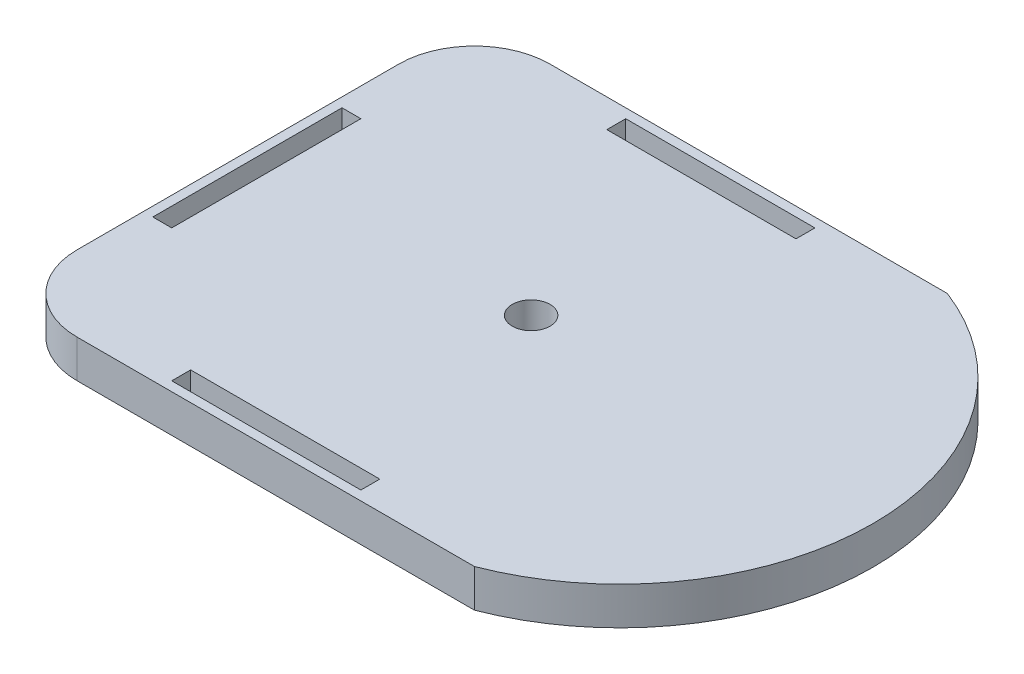
ISO-10303-21;
HEADER;
FILE_DESCRIPTION(('STEP AP214'),'2;1');
FILE_NAME('part.step','',(''),(''),'','','');
FILE_SCHEMA(('AUTOMOTIVE_DESIGN { 1 0 10303 214 1 1 1 1 }'));
ENDSEC;
DATA;
#1=APPLICATION_CONTEXT('core data for automotive mechanical design processes');
#2=APPLICATION_PROTOCOL_DEFINITION('international standard','automotive_design',2000,#1);
#3=PRODUCT_CONTEXT('',#1,'mechanical');
#4=PRODUCT('Part','Part','',(#3));
#5=PRODUCT_RELATED_PRODUCT_CATEGORY('part','',(#4));
#6=PRODUCT_DEFINITION_FORMATION('','',#4);
#7=PRODUCT_DEFINITION_CONTEXT('part definition',#1,'design');
#8=PRODUCT_DEFINITION('design','',#6,#7);
#9=PRODUCT_DEFINITION_SHAPE('','',#8);
#10=(LENGTH_UNIT() NAMED_UNIT(*) SI_UNIT(.MILLI.,.METRE.));
#11=(NAMED_UNIT(*) PLANE_ANGLE_UNIT() SI_UNIT($,.RADIAN.));
#12=(NAMED_UNIT(*) SI_UNIT($,.STERADIAN.) SOLID_ANGLE_UNIT());
#13=UNCERTAINTY_MEASURE_WITH_UNIT(LENGTH_MEASURE(1.E-05),#10,'distance_accuracy_value','');
#14=(GEOMETRIC_REPRESENTATION_CONTEXT(3) GLOBAL_UNCERTAINTY_ASSIGNED_CONTEXT((#13)) GLOBAL_UNIT_ASSIGNED_CONTEXT((#10,
#11,#12)) REPRESENTATION_CONTEXT('',''));
#15=CARTESIAN_POINT('',(0.,0.,0.));
#16=DIRECTION('',(0.,0.,1.));
#17=DIRECTION('',(1.,0.,0.));
#18=AXIS2_PLACEMENT_3D('',#15,#16,#17);
#19=CARTESIAN_POINT('',(120.608338299273,20.,-68.880424863026));
#20=DIRECTION('',(0.,-1.,0.));
#21=DIRECTION('',(0.,0.,-1.));
#22=AXIS2_PLACEMENT_3D('',#19,#20,#21);
#23=CYLINDRICAL_SURFACE('',#22,133.994925586997);
#24=CARTESIAN_POINT('',(120.608338299273,0.,-68.880424863026));
#25=DIRECTION('',(0.,1.,0.));
#26=DIRECTION('',(0.,0.,-1.));
#27=AXIS2_PLACEMENT_3D('',#24,#25,#26);
#28=CIRCLE('',#27,133.994925586997);
#29=CARTESIAN_POINT('',(168.874683541739,0.,56.119575136974));
#30=VERTEX_POINT('',#29);
#31=CARTESIAN_POINT('',(168.874683541739,0.,-193.880424863026));
#32=VERTEX_POINT('',#31);
#33=EDGE_CURVE('E202',#30,#32,#28,.T.);
#34=ORIENTED_EDGE('',*,*,#33,.T.);
#35=DIRECTION('',(0.,-1.,0.));
#36=VECTOR('',#35,1.);
#37=CARTESIAN_POINT('',(168.874683541739,20.,-193.880424863026));
#38=LINE('',#37,#36);
#39=CARTESIAN_POINT('',(168.874683541739,20.,-193.880424863026));
#40=VERTEX_POINT('',#39);
#41=EDGE_CURVE('E11',#40,#32,#38,.T.);
#42=ORIENTED_EDGE('',*,*,#41,.F.);
#43=CARTESIAN_POINT('',(120.608338299273,20.,-68.880424863026));
#44=DIRECTION('',(0.,1.,0.));
#45=DIRECTION('',(0.,0.,-1.));
#46=AXIS2_PLACEMENT_3D('',#43,#44,#45);
#47=CIRCLE('',#46,133.994925586997);
#48=CARTESIAN_POINT('',(168.874683541739,20.,56.119575136974));
#49=VERTEX_POINT('',#48);
#50=EDGE_CURVE('E268',#49,#40,#47,.T.);
#51=ORIENTED_EDGE('',*,*,#50,.F.);
#52=DIRECTION('',(0.,-1.,0.));
#53=VECTOR('',#52,1.);
#54=CARTESIAN_POINT('',(168.874683541739,20.,56.119575136974));
#55=LINE('',#54,#53);
#56=EDGE_CURVE('E282',#49,#30,#55,.T.);
#57=ORIENTED_EDGE('',*,*,#56,.T.);
#58=EDGE_LOOP('',(#34,#42,#51,#57));
#59=FACE_BOUND('',#58,.T.);
#60=ADVANCED_FACE('F40',(#59),#23,.T.);
#61=CARTESIAN_POINT('',(-41.1253164582612,20.,-193.880424863026));
#62=DIRECTION('',(0.,0.,1.));
#63=DIRECTION('',(1.,0.,0.));
#64=AXIS2_PLACEMENT_3D('',#61,#62,#63);
#65=PLANE('',#64);
#66=DIRECTION('',(-1.,0.,0.));
#67=VECTOR('',#66,1.);
#68=CARTESIAN_POINT('',(-41.1253164582612,0.,-193.880424863026));
#69=LINE('',#68,#67);
#70=CARTESIAN_POINT('',(-41.1253164582612,0.,-193.880424863026));
#71=VERTEX_POINT('',#70);
#72=EDGE_CURVE('E285',#32,#71,#69,.T.);
#73=ORIENTED_EDGE('',*,*,#72,.T.);
#74=DIRECTION('',(0.,-1.,0.));
#75=VECTOR('',#74,1.);
#76=CARTESIAN_POINT('',(-41.1253164582612,20.,-193.880424863026));
#77=LINE('',#76,#75);
#78=CARTESIAN_POINT('',(-41.1253164582612,20.,-193.880424863026));
#79=VERTEX_POINT('',#78);
#80=EDGE_CURVE('E48',#79,#71,#77,.T.);
#81=ORIENTED_EDGE('',*,*,#80,.F.);
#82=DIRECTION('',(-1.,0.,0.));
#83=VECTOR('',#82,1.);
#84=CARTESIAN_POINT('',(-41.1253164582612,20.,-193.880424863026));
#85=LINE('',#84,#83);
#86=EDGE_CURVE('E271',#40,#79,#85,.T.);
#87=ORIENTED_EDGE('',*,*,#86,.F.);
#88=ORIENTED_EDGE('',*,*,#41,.T.);
#89=EDGE_LOOP('',(#73,#81,#87,#88));
#90=FACE_BOUND('',#89,.T.);
#91=ADVANCED_FACE('F333',(#90),#65,.F.);
#92=CARTESIAN_POINT('',(-41.1253164582612,20.,-153.880424863026));
#93=DIRECTION('',(0.,-1.,0.));
#94=DIRECTION('',(0.,0.,-1.));
#95=AXIS2_PLACEMENT_3D('',#92,#93,#94);
#96=CYLINDRICAL_SURFACE('',#95,40.);
#97=CARTESIAN_POINT('',(-41.1253164582612,0.,-153.880424863026));
#98=DIRECTION('',(0.,1.,0.));
#99=DIRECTION('',(0.,0.,1.));
#100=AXIS2_PLACEMENT_3D('',#97,#98,#99);
#101=CIRCLE('',#100,40.);
#102=CARTESIAN_POINT('',(-81.1253164582612,0.,-153.880424863026));
#103=VERTEX_POINT('',#102);
#104=EDGE_CURVE('E287',#71,#103,#101,.T.);
#105=ORIENTED_EDGE('',*,*,#104,.T.);
#106=DIRECTION('',(0.,-1.,0.));
#107=VECTOR('',#106,1.);
#108=CARTESIAN_POINT('',(-81.1253164582612,20.,-153.880424863026));
#109=LINE('',#108,#107);
#110=CARTESIAN_POINT('',(-81.1253164582612,20.,-153.880424863026));
#111=VERTEX_POINT('',#110);
#112=EDGE_CURVE('E302',#111,#103,#109,.T.);
#113=ORIENTED_EDGE('',*,*,#112,.F.);
#114=CARTESIAN_POINT('',(-41.1253164582612,20.,-153.880424863026));
#115=DIRECTION('',(0.,1.,0.));
#116=DIRECTION('',(0.,0.,1.));
#117=AXIS2_PLACEMENT_3D('',#114,#115,#116);
#118=CIRCLE('',#117,40.);
#119=EDGE_CURVE('E274',#79,#111,#118,.T.);
#120=ORIENTED_EDGE('',*,*,#119,.F.);
#121=ORIENTED_EDGE('',*,*,#80,.T.);
#122=EDGE_LOOP('',(#105,#113,#120,#121));
#123=FACE_BOUND('',#122,.T.);
#124=ADVANCED_FACE('F310',(#123),#96,.T.);
#125=CARTESIAN_POINT('',(-81.1253164582612,20.,-153.880424863026));
#126=DIRECTION('',(1.,0.,0.));
#127=DIRECTION('',(0.,0.,-1.));
#128=AXIS2_PLACEMENT_3D('',#125,#126,#127);
#129=PLANE('',#128);
#130=DIRECTION('',(0.,0.,1.));
#131=VECTOR('',#130,1.);
#132=CARTESIAN_POINT('',(-81.1253164582612,0.,-153.880424863026));
#133=LINE('',#132,#131);
#134=CARTESIAN_POINT('',(-81.1253164582612,0.,16.119575136974));
#135=VERTEX_POINT('',#134);
#136=EDGE_CURVE('E289',#103,#135,#133,.T.);
#137=ORIENTED_EDGE('',*,*,#136,.T.);
#138=DIRECTION('',(0.,-1.,0.));
#139=VECTOR('',#138,1.);
#140=CARTESIAN_POINT('',(-81.1253164582612,20.,16.119575136974));
#141=LINE('',#140,#139);
#142=CARTESIAN_POINT('',(-81.1253164582612,20.,16.119575136974));
#143=VERTEX_POINT('',#142);
#144=EDGE_CURVE('E299',#143,#135,#141,.T.);
#145=ORIENTED_EDGE('',*,*,#144,.F.);
#146=DIRECTION('',(0.,0.,1.));
#147=VECTOR('',#146,1.);
#148=CARTESIAN_POINT('',(-81.1253164582612,20.,-153.880424863026));
#149=LINE('',#148,#147);
#150=EDGE_CURVE('E276',#111,#143,#149,.T.);
#151=ORIENTED_EDGE('',*,*,#150,.F.);
#152=ORIENTED_EDGE('',*,*,#112,.T.);
#153=EDGE_LOOP('',(#137,#145,#151,#152));
#154=FACE_BOUND('',#153,.T.);
#155=ADVANCED_FACE('F321',(#154),#129,.F.);
#156=CARTESIAN_POINT('',(-41.1253164582612,20.,16.119575136974));
#157=DIRECTION('',(0.,-1.,0.));
#158=DIRECTION('',(0.,0.,-1.));
#159=AXIS2_PLACEMENT_3D('',#156,#157,#158);
#160=CYLINDRICAL_SURFACE('',#159,40.);
#161=CARTESIAN_POINT('',(-41.1253164582612,0.,16.119575136974));
#162=DIRECTION('',(0.,1.,0.));
#163=DIRECTION('',(0.,0.,1.));
#164=AXIS2_PLACEMENT_3D('',#161,#162,#163);
#165=CIRCLE('',#164,40.);
#166=CARTESIAN_POINT('',(-41.1253164582612,0.,56.119575136974));
#167=VERTEX_POINT('',#166);
#168=EDGE_CURVE('E291',#135,#167,#165,.T.);
#169=ORIENTED_EDGE('',*,*,#168,.T.);
#170=DIRECTION('',(0.,-1.,0.));
#171=VECTOR('',#170,1.);
#172=CARTESIAN_POINT('',(-41.1253164582612,20.,56.119575136974));
#173=LINE('',#172,#171);
#174=CARTESIAN_POINT('',(-41.1253164582612,20.,56.119575136974));
#175=VERTEX_POINT('',#174);
#176=EDGE_CURVE('E296',#175,#167,#173,.T.);
#177=ORIENTED_EDGE('',*,*,#176,.F.);
#178=CARTESIAN_POINT('',(-41.1253164582612,20.,16.119575136974));
#179=DIRECTION('',(0.,1.,0.));
#180=DIRECTION('',(0.,0.,1.));
#181=AXIS2_PLACEMENT_3D('',#178,#179,#180);
#182=CIRCLE('',#181,40.);
#183=EDGE_CURVE('E278',#143,#175,#182,.T.);
#184=ORIENTED_EDGE('',*,*,#183,.F.);
#185=ORIENTED_EDGE('',*,*,#144,.T.);
#186=EDGE_LOOP('',(#169,#177,#184,#185));
#187=FACE_BOUND('',#186,.T.);
#188=ADVANCED_FACE('F325',(#187),#160,.T.);
#189=CARTESIAN_POINT('',(-41.1253164582612,20.,56.119575136974));
#190=DIRECTION('',(0.,0.,-1.));
#191=DIRECTION('',(-1.,0.,0.));
#192=AXIS2_PLACEMENT_3D('',#189,#190,#191);
#193=PLANE('',#192);
#194=DIRECTION('',(1.,0.,0.));
#195=VECTOR('',#194,1.);
#196=CARTESIAN_POINT('',(-41.1253164582612,0.,56.119575136974));
#197=LINE('',#196,#195);
#198=EDGE_CURVE('E272',#167,#30,#197,.T.);
#199=ORIENTED_EDGE('',*,*,#198,.T.);
#200=ORIENTED_EDGE('',*,*,#56,.F.);
#201=DIRECTION('',(1.,0.,0.));
#202=VECTOR('',#201,1.);
#203=CARTESIAN_POINT('',(-41.1253164582612,20.,56.119575136974));
#204=LINE('',#203,#202);
#205=EDGE_CURVE('E280',#175,#49,#204,.T.);
#206=ORIENTED_EDGE('',*,*,#205,.F.);
#207=ORIENTED_EDGE('',*,*,#176,.T.);
#208=EDGE_LOOP('',(#199,#200,#206,#207));
#209=FACE_BOUND('',#208,.T.);
#210=ADVANCED_FACE('F336',(#209),#193,.F.);
#211=CARTESIAN_POINT('',(120.608338299273,20.,-68.880424863026));
#212=DIRECTION('',(0.,-1.,0.));
#213=DIRECTION('',(0.,0.,-1.));
#214=AXIS2_PLACEMENT_3D('',#211,#212,#213);
#215=PLANE('',#214);
#216=CARTESIAN_POINT('',(68.8746835417388,20.,-73.880424863026));
#217=DIRECTION('',(0.,1.,0.));
#218=DIRECTION('',(0.,0.,1.));
#219=AXIS2_PLACEMENT_3D('',#216,#217,#218);
#220=CIRCLE('',#219,9.99999999999999);
#221=CARTESIAN_POINT('',(68.8746835417388,20.,-63.880424863026));
#222=VERTEX_POINT('',#221);
#223=EDGE_CURVE('E191',#222,#222,#220,.T.);
#224=ORIENTED_EDGE('',*,*,#223,.F.);
#225=EDGE_LOOP('',(#224));
#226=FACE_BOUND('',#225,.T.);
#227=DIRECTION('',(1.,0.,0.));
#228=VECTOR('',#227,1.);
#229=CARTESIAN_POINT('',(3.8746835417388,20.,-178.880424863026));
#230=LINE('',#229,#228);
#231=CARTESIAN_POINT('',(3.8746835417388,20.,-178.880424863026));
#232=VERTEX_POINT('',#231);
#233=CARTESIAN_POINT('',(103.874683541739,20.,-178.880424863026));
#234=VERTEX_POINT('',#233);
#235=EDGE_CURVE('E196',#232,#234,#230,.T.);
#236=ORIENTED_EDGE('',*,*,#235,.F.);
#237=DIRECTION('',(0.,0.,1.));
#238=VECTOR('',#237,1.);
#239=CARTESIAN_POINT('',(3.8746835417388,20.,-188.880424863026));
#240=LINE('',#239,#238);
#241=CARTESIAN_POINT('',(3.8746835417388,20.,-188.880424863026));
#242=VERTEX_POINT('',#241);
#243=EDGE_CURVE('E55',#242,#232,#240,.T.);
#244=ORIENTED_EDGE('',*,*,#243,.F.);
#245=DIRECTION('',(-1.,0.,0.));
#246=VECTOR('',#245,1.);
#247=CARTESIAN_POINT('',(3.8746835417388,20.,-188.880424863026));
#248=LINE('',#247,#246);
#249=CARTESIAN_POINT('',(103.874683541739,20.,-188.880424863026));
#250=VERTEX_POINT('',#249);
#251=EDGE_CURVE('E185',#250,#242,#248,.T.);
#252=ORIENTED_EDGE('',*,*,#251,.F.);
#253=DIRECTION('',(0.,0.,-1.));
#254=VECTOR('',#253,1.);
#255=CARTESIAN_POINT('',(103.874683541739,20.,-188.880424863026));
#256=LINE('',#255,#254);
#257=EDGE_CURVE('E188',#234,#250,#256,.T.);
#258=ORIENTED_EDGE('',*,*,#257,.F.);
#259=EDGE_LOOP('',(#236,#244,#252,#258));
#260=FACE_BOUND('',#259,.T.);
#261=DIRECTION('',(1.,0.,0.));
#262=VECTOR('',#261,1.);
#263=CARTESIAN_POINT('',(-76.1253164582612,20.,-18.880424863026));
#264=LINE('',#263,#262);
#265=CARTESIAN_POINT('',(-76.1253164582612,20.,-18.880424863026));
#266=VERTEX_POINT('',#265);
#267=CARTESIAN_POINT('',(-66.1253164582612,20.,-18.880424863026));
#268=VERTEX_POINT('',#267);
#269=EDGE_CURVE('E223',#266,#268,#264,.T.);
#270=ORIENTED_EDGE('',*,*,#269,.F.);
#271=DIRECTION('',(0.,0.,1.));
#272=VECTOR('',#271,1.);
#273=CARTESIAN_POINT('',(-76.1253164582612,20.,-118.880424863026));
#274=LINE('',#273,#272);
#275=CARTESIAN_POINT('',(-76.1253164582612,20.,-118.880424863026));
#276=VERTEX_POINT('',#275);
#277=EDGE_CURVE('E63',#276,#266,#274,.T.);
#278=ORIENTED_EDGE('',*,*,#277,.F.);
#279=DIRECTION('',(-1.,0.,0.));
#280=VECTOR('',#279,1.);
#281=CARTESIAN_POINT('',(-76.1253164582612,20.,-118.880424863026));
#282=LINE('',#281,#280);
#283=CARTESIAN_POINT('',(-66.1253164582612,20.,-118.880424863026));
#284=VERTEX_POINT('',#283);
#285=EDGE_CURVE('E216',#284,#276,#282,.T.);
#286=ORIENTED_EDGE('',*,*,#285,.F.);
#287=DIRECTION('',(0.,0.,-1.));
#288=VECTOR('',#287,1.);
#289=CARTESIAN_POINT('',(-66.1253164582612,20.,-118.880424863026));
#290=LINE('',#289,#288);
#291=EDGE_CURVE('E219',#268,#284,#290,.T.);
#292=ORIENTED_EDGE('',*,*,#291,.F.);
#293=EDGE_LOOP('',(#270,#278,#286,#292));
#294=FACE_BOUND('',#293,.T.);
#295=DIRECTION('',(1.,0.,0.));
#296=VECTOR('',#295,1.);
#297=CARTESIAN_POINT('',(3.87468354173883,20.,51.119575136974));
#298=LINE('',#297,#296);
#299=CARTESIAN_POINT('',(3.87468354173882,20.,51.119575136974));
#300=VERTEX_POINT('',#299);
#301=CARTESIAN_POINT('',(103.874683541739,20.,51.119575136974));
#302=VERTEX_POINT('',#301);
#303=EDGE_CURVE('E254',#300,#302,#298,.T.);
#304=ORIENTED_EDGE('',*,*,#303,.F.);
#305=DIRECTION('',(0.,0.,1.));
#306=VECTOR('',#305,1.);
#307=CARTESIAN_POINT('',(3.87468354173883,20.,51.119575136974));
#308=LINE('',#307,#306);
#309=CARTESIAN_POINT('',(3.87468354173882,20.,41.119575136974));
#310=VERTEX_POINT('',#309);
#311=EDGE_CURVE('E215',#310,#300,#308,.T.);
#312=ORIENTED_EDGE('',*,*,#311,.F.);
#313=DIRECTION('',(-1.,0.,0.));
#314=VECTOR('',#313,1.);
#315=CARTESIAN_POINT('',(3.87468354173882,20.,41.119575136974));
#316=LINE('',#315,#314);
#317=CARTESIAN_POINT('',(103.874683541739,20.,41.119575136974));
#318=VERTEX_POINT('',#317);
#319=EDGE_CURVE('E247',#318,#310,#316,.T.);
#320=ORIENTED_EDGE('',*,*,#319,.F.);
#321=DIRECTION('',(0.,0.,-1.));
#322=VECTOR('',#321,1.);
#323=CARTESIAN_POINT('',(103.874683541739,20.,51.119575136974));
#324=LINE('',#323,#322);
#325=EDGE_CURVE('E250',#302,#318,#324,.T.);
#326=ORIENTED_EDGE('',*,*,#325,.F.);
#327=EDGE_LOOP('',(#304,#312,#320,#326));
#328=FACE_BOUND('',#327,.T.);
#329=ORIENTED_EDGE('',*,*,#50,.T.);
#330=ORIENTED_EDGE('',*,*,#86,.T.);
#331=ORIENTED_EDGE('',*,*,#119,.T.);
#332=ORIENTED_EDGE('',*,*,#150,.T.);
#333=ORIENTED_EDGE('',*,*,#183,.T.);
#334=ORIENTED_EDGE('',*,*,#205,.T.);
#335=EDGE_LOOP('',(#329,#330,#331,#332,#333,#334));
#336=FACE_BOUND('',#335,.T.);
#337=ADVANCED_FACE('F329',(#226,#260,#294,#328,#336),#215,.F.);
#338=CARTESIAN_POINT('',(120.608338299273,0.,-68.880424863026));
#339=DIRECTION('',(0.,-1.,0.));
#340=DIRECTION('',(0.,0.,-1.));
#341=AXIS2_PLACEMENT_3D('',#338,#339,#340);
#342=PLANE('',#341);
#343=CARTESIAN_POINT('',(68.8746835417388,0.,-73.880424863026));
#344=DIRECTION('',(0.,-1.,0.));
#345=DIRECTION('',(0.,0.,-1.));
#346=AXIS2_PLACEMENT_3D('',#343,#344,#345);
#347=CIRCLE('',#346,9.99999999999999);
#348=CARTESIAN_POINT('',(68.8746835417388,0.,-83.880424863026));
#349=VERTEX_POINT('',#348);
#350=EDGE_CURVE('E43',#349,#349,#347,.T.);
#351=ORIENTED_EDGE('',*,*,#350,.F.);
#352=EDGE_LOOP('',(#351));
#353=FACE_BOUND('',#352,.T.);
#354=ORIENTED_EDGE('',*,*,#33,.F.);
#355=ORIENTED_EDGE('',*,*,#198,.F.);
#356=ORIENTED_EDGE('',*,*,#168,.F.);
#357=ORIENTED_EDGE('',*,*,#136,.F.);
#358=ORIENTED_EDGE('',*,*,#104,.F.);
#359=ORIENTED_EDGE('',*,*,#72,.F.);
#360=EDGE_LOOP('',(#354,#355,#356,#357,#358,#359));
#361=FACE_BOUND('',#360,.T.);
#362=ADVANCED_FACE('F316',(#353,#361),#342,.T.);
#363=CARTESIAN_POINT('',(3.87468354173883,7.5,51.119575136974));
#364=DIRECTION('',(-1.,0.,0.));
#365=DIRECTION('',(0.,0.,1.));
#366=AXIS2_PLACEMENT_3D('',#363,#364,#365);
#367=PLANE('',#366);
#368=ORIENTED_EDGE('',*,*,#311,.T.);
#369=DIRECTION('',(0.,1.,0.));
#370=VECTOR('',#369,1.);
#371=CARTESIAN_POINT('',(3.87468354173883,7.5,51.119575136974));
#372=LINE('',#371,#370);
#373=CARTESIAN_POINT('',(3.87468354173883,7.5,51.119575136974));
#374=VERTEX_POINT('',#373);
#375=EDGE_CURVE('E237',#374,#300,#372,.T.);
#376=ORIENTED_EDGE('',*,*,#375,.F.);
#377=DIRECTION('',(0.,0.,1.));
#378=VECTOR('',#377,1.);
#379=CARTESIAN_POINT('',(3.87468354173883,7.5,51.119575136974));
#380=LINE('',#379,#378);
#381=CARTESIAN_POINT('',(3.87468354173882,7.5,41.119575136974));
#382=VERTEX_POINT('',#381);
#383=EDGE_CURVE('E251',#382,#374,#380,.T.);
#384=ORIENTED_EDGE('',*,*,#383,.F.);
#385=DIRECTION('',(0.,1.,0.));
#386=VECTOR('',#385,1.);
#387=CARTESIAN_POINT('',(3.87468354173882,7.5,41.119575136974));
#388=LINE('',#387,#386);
#389=EDGE_CURVE('E245',#382,#310,#388,.T.);
#390=ORIENTED_EDGE('',*,*,#389,.T.);
#391=EDGE_LOOP('',(#368,#376,#384,#390));
#392=FACE_BOUND('',#391,.T.);
#393=ADVANCED_FACE('F377',(#392),#367,.F.);
#394=CARTESIAN_POINT('',(3.87468354173882,7.5,41.119575136974));
#395=DIRECTION('',(0.,0.,-1.));
#396=DIRECTION('',(-1.,0.,0.));
#397=AXIS2_PLACEMENT_3D('',#394,#395,#396);
#398=PLANE('',#397);
#399=ORIENTED_EDGE('',*,*,#319,.T.);
#400=ORIENTED_EDGE('',*,*,#389,.F.);
#401=DIRECTION('',(-1.,0.,0.));
#402=VECTOR('',#401,1.);
#403=CARTESIAN_POINT('',(3.87468354173882,7.5,41.119575136974));
#404=LINE('',#403,#402);
#405=CARTESIAN_POINT('',(103.874683541739,7.5,41.119575136974));
#406=VERTEX_POINT('',#405);
#407=EDGE_CURVE('E240',#406,#382,#404,.T.);
#408=ORIENTED_EDGE('',*,*,#407,.F.);
#409=DIRECTION('',(0.,1.,0.));
#410=VECTOR('',#409,1.);
#411=CARTESIAN_POINT('',(103.874683541739,7.5,41.119575136974));
#412=LINE('',#411,#410);
#413=EDGE_CURVE('E243',#406,#318,#412,.T.);
#414=ORIENTED_EDGE('',*,*,#413,.T.);
#415=EDGE_LOOP('',(#399,#400,#408,#414));
#416=FACE_BOUND('',#415,.T.);
#417=ADVANCED_FACE('F382',(#416),#398,.F.);
#418=CARTESIAN_POINT('',(103.874683541739,7.5,51.119575136974));
#419=DIRECTION('',(1.,0.,0.));
#420=DIRECTION('',(0.,0.,-1.));
#421=AXIS2_PLACEMENT_3D('',#418,#419,#420);
#422=PLANE('',#421);
#423=ORIENTED_EDGE('',*,*,#325,.T.);
#424=ORIENTED_EDGE('',*,*,#413,.F.);
#425=DIRECTION('',(0.,0.,-1.));
#426=VECTOR('',#425,1.);
#427=CARTESIAN_POINT('',(103.874683541739,7.5,51.119575136974));
#428=LINE('',#427,#426);
#429=CARTESIAN_POINT('',(103.874683541739,7.5,51.119575136974));
#430=VERTEX_POINT('',#429);
#431=EDGE_CURVE('E260',#430,#406,#428,.T.);
#432=ORIENTED_EDGE('',*,*,#431,.F.);
#433=DIRECTION('',(0.,1.,0.));
#434=VECTOR('',#433,1.);
#435=CARTESIAN_POINT('',(103.874683541739,7.5,51.119575136974));
#436=LINE('',#435,#434);
#437=EDGE_CURVE('E241',#430,#302,#436,.T.);
#438=ORIENTED_EDGE('',*,*,#437,.T.);
#439=EDGE_LOOP('',(#423,#424,#432,#438));
#440=FACE_BOUND('',#439,.T.);
#441=ADVANCED_FACE('F395',(#440),#422,.F.);
#442=CARTESIAN_POINT('',(3.87468354173883,7.5,51.119575136974));
#443=DIRECTION('',(0.,0.,1.));
#444=DIRECTION('',(1.,0.,0.));
#445=AXIS2_PLACEMENT_3D('',#442,#443,#444);
#446=PLANE('',#445);
#447=ORIENTED_EDGE('',*,*,#303,.T.);
#448=ORIENTED_EDGE('',*,*,#437,.F.);
#449=DIRECTION('',(1.,0.,0.));
#450=VECTOR('',#449,1.);
#451=CARTESIAN_POINT('',(3.87468354173883,7.5,51.119575136974));
#452=LINE('',#451,#450);
#453=EDGE_CURVE('E263',#374,#430,#452,.T.);
#454=ORIENTED_EDGE('',*,*,#453,.F.);
#455=ORIENTED_EDGE('',*,*,#375,.T.);
#456=EDGE_LOOP('',(#447,#448,#454,#455));
#457=FACE_BOUND('',#456,.T.);
#458=ADVANCED_FACE('F406',(#457),#446,.F.);
#459=CARTESIAN_POINT('',(0.,7.5,0.));
#460=DIRECTION('',(0.,-1.,0.));
#461=DIRECTION('',(0.,0.,-1.));
#462=AXIS2_PLACEMENT_3D('',#459,#460,#461);
#463=PLANE('',#462);
#464=ORIENTED_EDGE('',*,*,#383,.T.);
#465=ORIENTED_EDGE('',*,*,#453,.T.);
#466=ORIENTED_EDGE('',*,*,#431,.T.);
#467=ORIENTED_EDGE('',*,*,#407,.T.);
#468=EDGE_LOOP('',(#464,#465,#466,#467));
#469=FACE_BOUND('',#468,.T.);
#470=ADVANCED_FACE('F417',(#469),#463,.F.);
#471=CARTESIAN_POINT('',(-76.1253164582612,7.5,-118.880424863026));
#472=DIRECTION('',(-1.,0.,0.));
#473=DIRECTION('',(0.,0.,1.));
#474=AXIS2_PLACEMENT_3D('',#471,#472,#473);
#475=PLANE('',#474);
#476=ORIENTED_EDGE('',*,*,#277,.T.);
#477=DIRECTION('',(0.,1.,0.));
#478=VECTOR('',#477,1.);
#479=CARTESIAN_POINT('',(-76.1253164582612,7.5,-18.880424863026));
#480=LINE('',#479,#478);
#481=CARTESIAN_POINT('',(-76.1253164582612,7.5,-18.880424863026));
#482=VERTEX_POINT('',#481);
#483=EDGE_CURVE('E206',#482,#266,#480,.T.);
#484=ORIENTED_EDGE('',*,*,#483,.F.);
#485=DIRECTION('',(0.,0.,1.));
#486=VECTOR('',#485,1.);
#487=CARTESIAN_POINT('',(-76.1253164582612,7.5,-118.880424863026));
#488=LINE('',#487,#486);
#489=CARTESIAN_POINT('',(-76.1253164582612,7.5,-118.880424863026));
#490=VERTEX_POINT('',#489);
#491=EDGE_CURVE('E220',#490,#482,#488,.T.);
#492=ORIENTED_EDGE('',*,*,#491,.F.);
#493=DIRECTION('',(0.,1.,0.));
#494=VECTOR('',#493,1.);
#495=CARTESIAN_POINT('',(-76.1253164582612,7.5,-118.880424863026));
#496=LINE('',#495,#494);
#497=EDGE_CURVE('E213',#490,#276,#496,.T.);
#498=ORIENTED_EDGE('',*,*,#497,.T.);
#499=EDGE_LOOP('',(#476,#484,#492,#498));
#500=FACE_BOUND('',#499,.T.);
#501=ADVANCED_FACE('F428',(#500),#475,.F.);
#502=CARTESIAN_POINT('',(-76.1253164582612,7.5,-118.880424863026));
#503=DIRECTION('',(0.,0.,-1.));
#504=DIRECTION('',(-1.,0.,0.));
#505=AXIS2_PLACEMENT_3D('',#502,#503,#504);
#506=PLANE('',#505);
#507=ORIENTED_EDGE('',*,*,#285,.T.);
#508=ORIENTED_EDGE('',*,*,#497,.F.);
#509=DIRECTION('',(-1.,0.,0.));
#510=VECTOR('',#509,1.);
#511=CARTESIAN_POINT('',(-76.1253164582612,7.5,-118.880424863026));
#512=LINE('',#511,#510);
#513=CARTESIAN_POINT('',(-66.1253164582612,7.5,-118.880424863026));
#514=VERTEX_POINT('',#513);
#515=EDGE_CURVE('E208',#514,#490,#512,.T.);
#516=ORIENTED_EDGE('',*,*,#515,.F.);
#517=DIRECTION('',(0.,1.,0.));
#518=VECTOR('',#517,1.);
#519=CARTESIAN_POINT('',(-66.1253164582612,7.5,-118.880424863026));
#520=LINE('',#519,#518);
#521=EDGE_CURVE('E211',#514,#284,#520,.T.);
#522=ORIENTED_EDGE('',*,*,#521,.T.);
#523=EDGE_LOOP('',(#507,#508,#516,#522));
#524=FACE_BOUND('',#523,.T.);
#525=ADVANCED_FACE('F439',(#524),#506,.F.);
#526=CARTESIAN_POINT('',(-66.1253164582612,7.5,-118.880424863026));
#527=DIRECTION('',(1.,0.,0.));
#528=DIRECTION('',(0.,0.,-1.));
#529=AXIS2_PLACEMENT_3D('',#526,#527,#528);
#530=PLANE('',#529);
#531=ORIENTED_EDGE('',*,*,#291,.T.);
#532=ORIENTED_EDGE('',*,*,#521,.F.);
#533=DIRECTION('',(0.,0.,-1.));
#534=VECTOR('',#533,1.);
#535=CARTESIAN_POINT('',(-66.1253164582612,7.5,-118.880424863026));
#536=LINE('',#535,#534);
#537=CARTESIAN_POINT('',(-66.1253164582612,7.5,-18.880424863026));
#538=VERTEX_POINT('',#537);
#539=EDGE_CURVE('E229',#538,#514,#536,.T.);
#540=ORIENTED_EDGE('',*,*,#539,.F.);
#541=DIRECTION('',(0.,1.,0.));
#542=VECTOR('',#541,1.);
#543=CARTESIAN_POINT('',(-66.1253164582612,7.5,-18.880424863026));
#544=LINE('',#543,#542);
#545=EDGE_CURVE('E209',#538,#268,#544,.T.);
#546=ORIENTED_EDGE('',*,*,#545,.T.);
#547=EDGE_LOOP('',(#531,#532,#540,#546));
#548=FACE_BOUND('',#547,.T.);
#549=ADVANCED_FACE('F449',(#548),#530,.F.);
#550=CARTESIAN_POINT('',(-76.1253164582612,7.5,-18.880424863026));
#551=DIRECTION('',(0.,0.,1.));
#552=DIRECTION('',(1.,0.,0.));
#553=AXIS2_PLACEMENT_3D('',#550,#551,#552);
#554=PLANE('',#553);
#555=ORIENTED_EDGE('',*,*,#269,.T.);
#556=ORIENTED_EDGE('',*,*,#545,.F.);
#557=DIRECTION('',(1.,0.,0.));
#558=VECTOR('',#557,1.);
#559=CARTESIAN_POINT('',(-76.1253164582612,7.5,-18.880424863026));
#560=LINE('',#559,#558);
#561=EDGE_CURVE('E232',#482,#538,#560,.T.);
#562=ORIENTED_EDGE('',*,*,#561,.F.);
#563=ORIENTED_EDGE('',*,*,#483,.T.);
#564=EDGE_LOOP('',(#555,#556,#562,#563));
#565=FACE_BOUND('',#564,.T.);
#566=ADVANCED_FACE('F460',(#565),#554,.F.);
#567=CARTESIAN_POINT('',(0.,7.5,0.));
#568=DIRECTION('',(0.,1.,0.));
#569=DIRECTION('',(0.,0.,1.));
#570=AXIS2_PLACEMENT_3D('',#567,#568,#569);
#571=PLANE('',#570);
#572=ORIENTED_EDGE('',*,*,#491,.T.);
#573=ORIENTED_EDGE('',*,*,#561,.T.);
#574=ORIENTED_EDGE('',*,*,#539,.T.);
#575=ORIENTED_EDGE('',*,*,#515,.T.);
#576=EDGE_LOOP('',(#572,#573,#574,#575));
#577=FACE_BOUND('',#576,.T.);
#578=ADVANCED_FACE('F471',(#577),#571,.T.);
#579=CARTESIAN_POINT('',(3.8746835417388,7.5,-188.880424863026));
#580=DIRECTION('',(-1.,0.,0.));
#581=DIRECTION('',(0.,0.,1.));
#582=AXIS2_PLACEMENT_3D('',#579,#580,#581);
#583=PLANE('',#582);
#584=ORIENTED_EDGE('',*,*,#243,.T.);
#585=DIRECTION('',(0.,1.,0.));
#586=VECTOR('',#585,1.);
#587=CARTESIAN_POINT('',(3.8746835417388,7.5,-178.880424863026));
#588=LINE('',#587,#586);
#589=CARTESIAN_POINT('',(3.8746835417388,7.5,-178.880424863026));
#590=VERTEX_POINT('',#589);
#591=EDGE_CURVE('E163',#590,#232,#588,.T.);
#592=ORIENTED_EDGE('',*,*,#591,.F.);
#593=DIRECTION('',(0.,0.,1.));
#594=VECTOR('',#593,1.);
#595=CARTESIAN_POINT('',(3.8746835417388,7.5,-188.880424863026));
#596=LINE('',#595,#594);
#597=CARTESIAN_POINT('',(3.8746835417388,7.5,-188.880424863026));
#598=VERTEX_POINT('',#597);
#599=EDGE_CURVE('E167',#598,#590,#596,.T.);
#600=ORIENTED_EDGE('',*,*,#599,.F.);
#601=DIRECTION('',(0.,1.,0.));
#602=VECTOR('',#601,1.);
#603=CARTESIAN_POINT('',(3.8746835417388,7.5,-188.880424863026));
#604=LINE('',#603,#602);
#605=EDGE_CURVE('E200',#598,#242,#604,.T.);
#606=ORIENTED_EDGE('',*,*,#605,.T.);
#607=EDGE_LOOP('',(#584,#592,#600,#606));
#608=FACE_BOUND('',#607,.T.);
#609=ADVANCED_FACE('F165',(#608),#583,.F.);
#610=CARTESIAN_POINT('',(3.8746835417388,7.5,-188.880424863026));
#611=DIRECTION('',(0.,0.,-1.));
#612=DIRECTION('',(-1.,0.,0.));
#613=AXIS2_PLACEMENT_3D('',#610,#611,#612);
#614=PLANE('',#613);
#615=ORIENTED_EDGE('',*,*,#251,.T.);
#616=ORIENTED_EDGE('',*,*,#605,.F.);
#617=DIRECTION('',(-1.,0.,0.));
#618=VECTOR('',#617,1.);
#619=CARTESIAN_POINT('',(3.8746835417388,7.5,-188.880424863026));
#620=LINE('',#619,#618);
#621=CARTESIAN_POINT('',(103.874683541739,7.5,-188.880424863026));
#622=VERTEX_POINT('',#621);
#623=EDGE_CURVE('E173',#622,#598,#620,.T.);
#624=ORIENTED_EDGE('',*,*,#623,.F.);
#625=DIRECTION('',(0.,1.,0.));
#626=VECTOR('',#625,1.);
#627=CARTESIAN_POINT('',(103.874683541739,7.5,-188.880424863026));
#628=LINE('',#627,#626);
#629=EDGE_CURVE('E203',#622,#250,#628,.T.);
#630=ORIENTED_EDGE('',*,*,#629,.T.);
#631=EDGE_LOOP('',(#615,#616,#624,#630));
#632=FACE_BOUND('',#631,.T.);
#633=ADVANCED_FACE('F492',(#632),#614,.F.);
#634=CARTESIAN_POINT('',(103.874683541739,7.5,-188.880424863026));
#635=DIRECTION('',(1.,0.,0.));
#636=DIRECTION('',(0.,0.,-1.));
#637=AXIS2_PLACEMENT_3D('',#634,#635,#636);
#638=PLANE('',#637);
#639=ORIENTED_EDGE('',*,*,#257,.T.);
#640=ORIENTED_EDGE('',*,*,#629,.F.);
#641=DIRECTION('',(0.,0.,-1.));
#642=VECTOR('',#641,1.);
#643=CARTESIAN_POINT('',(103.874683541739,7.5,-188.880424863026));
#644=LINE('',#643,#642);
#645=CARTESIAN_POINT('',(103.874683541739,7.5,-178.880424863026));
#646=VERTEX_POINT('',#645);
#647=EDGE_CURVE('E181',#646,#622,#644,.T.);
#648=ORIENTED_EDGE('',*,*,#647,.F.);
#649=DIRECTION('',(0.,1.,0.));
#650=VECTOR('',#649,1.);
#651=CARTESIAN_POINT('',(103.874683541739,7.5,-178.880424863026));
#652=LINE('',#651,#650);
#653=EDGE_CURVE('E172',#646,#234,#652,.T.);
#654=ORIENTED_EDGE('',*,*,#653,.T.);
#655=EDGE_LOOP('',(#639,#640,#648,#654));
#656=FACE_BOUND('',#655,.T.);
#657=ADVANCED_FACE('F502',(#656),#638,.F.);
#658=CARTESIAN_POINT('',(3.8746835417388,7.5,-178.880424863026));
#659=DIRECTION('',(0.,0.,1.));
#660=DIRECTION('',(1.,0.,0.));
#661=AXIS2_PLACEMENT_3D('',#658,#659,#660);
#662=PLANE('',#661);
#663=ORIENTED_EDGE('',*,*,#235,.T.);
#664=ORIENTED_EDGE('',*,*,#653,.F.);
#665=DIRECTION('',(1.,0.,0.));
#666=VECTOR('',#665,1.);
#667=CARTESIAN_POINT('',(3.8746835417388,7.5,-178.880424863026));
#668=LINE('',#667,#666);
#669=EDGE_CURVE('E176',#590,#646,#668,.T.);
#670=ORIENTED_EDGE('',*,*,#669,.F.);
#671=ORIENTED_EDGE('',*,*,#591,.T.);
#672=EDGE_LOOP('',(#663,#664,#670,#671));
#673=FACE_BOUND('',#672,.T.);
#674=ADVANCED_FACE('F177',(#673),#662,.F.);
#675=CARTESIAN_POINT('',(0.,7.5,0.));
#676=DIRECTION('',(0.,1.,0.));
#677=DIRECTION('',(0.,0.,1.));
#678=AXIS2_PLACEMENT_3D('',#675,#676,#677);
#679=PLANE('',#678);
#680=ORIENTED_EDGE('',*,*,#599,.T.);
#681=ORIENTED_EDGE('',*,*,#669,.T.);
#682=ORIENTED_EDGE('',*,*,#647,.T.);
#683=ORIENTED_EDGE('',*,*,#623,.T.);
#684=EDGE_LOOP('',(#680,#681,#682,#683));
#685=FACE_BOUND('',#684,.T.);
#686=ADVANCED_FACE('F183',(#685),#679,.T.);
#687=CARTESIAN_POINT('',(68.8746835417388,-210.5,-73.880424863026));
#688=DIRECTION('',(0.,1.,0.));
#689=DIRECTION('',(0.,0.,1.));
#690=AXIS2_PLACEMENT_3D('',#687,#688,#689);
#691=CYLINDRICAL_SURFACE('',#690,9.99999999999999);
#692=ORIENTED_EDGE('',*,*,#350,.T.);
#693=EDGE_LOOP('',(#692));
#694=FACE_BOUND('',#693,.T.);
#695=ORIENTED_EDGE('',*,*,#223,.T.);
#696=EDGE_LOOP('',(#695));
#697=FACE_BOUND('',#696,.T.);
#698=ADVANCED_FACE('F532',(#694,#697),#691,.F.);
#699=CLOSED_SHELL('',(#60,#91,#124,#155,#188,#210,#337,#362,#393,#417,#441,#458,#470,#501,#525,
#549,#566,#578,#609,#633,#657,#674,#686,#698));
#700=MANIFOLD_SOLID_BREP('B2',#699);
#701=ADVANCED_BREP_SHAPE_REPRESENTATION('',(#18,#700),#14);
#702=SHAPE_DEFINITION_REPRESENTATION(#9,#701);
ENDSEC;
END-ISO-10303-21;
